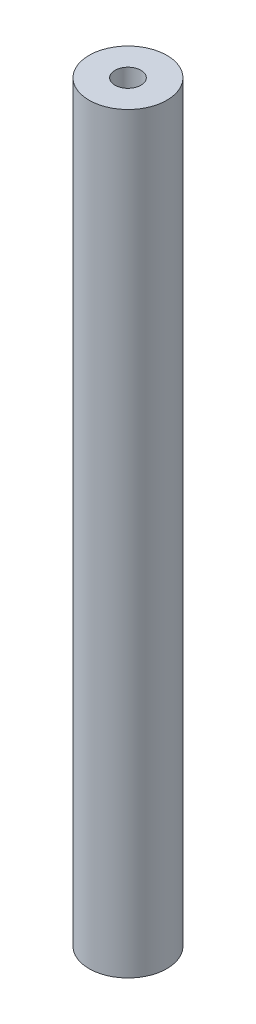
ISO-10303-21;
HEADER;
FILE_DESCRIPTION(('STEP AP214'),'2;1');
FILE_NAME('part.step','',(''),(''),'','','');
FILE_SCHEMA(('AUTOMOTIVE_DESIGN { 1 0 10303 214 1 1 1 1 }'));
ENDSEC;
DATA;
#1=APPLICATION_CONTEXT('core data for automotive mechanical design processes');
#2=APPLICATION_PROTOCOL_DEFINITION('international standard','automotive_design',2000,#1);
#3=PRODUCT_CONTEXT('',#1,'mechanical');
#4=PRODUCT('Part','Part','',(#3));
#5=PRODUCT_RELATED_PRODUCT_CATEGORY('part','',(#4));
#6=PRODUCT_DEFINITION_FORMATION('','',#4);
#7=PRODUCT_DEFINITION_CONTEXT('part definition',#1,'design');
#8=PRODUCT_DEFINITION('design','',#6,#7);
#9=PRODUCT_DEFINITION_SHAPE('','',#8);
#10=(LENGTH_UNIT() NAMED_UNIT(*) SI_UNIT(.MILLI.,.METRE.));
#11=(NAMED_UNIT(*) PLANE_ANGLE_UNIT() SI_UNIT($,.RADIAN.));
#12=(NAMED_UNIT(*) SI_UNIT($,.STERADIAN.) SOLID_ANGLE_UNIT());
#13=UNCERTAINTY_MEASURE_WITH_UNIT(LENGTH_MEASURE(1.E-05),#10,'distance_accuracy_value','');
#14=(GEOMETRIC_REPRESENTATION_CONTEXT(3) GLOBAL_UNCERTAINTY_ASSIGNED_CONTEXT((#13)) GLOBAL_UNIT_ASSIGNED_CONTEXT((#10,
#11,#12)) REPRESENTATION_CONTEXT('',''));
#15=CARTESIAN_POINT('',(0.,0.,0.));
#16=DIRECTION('',(0.,0.,1.));
#17=DIRECTION('',(1.,0.,0.));
#18=AXIS2_PLACEMENT_3D('',#15,#16,#17);
#19=CARTESIAN_POINT('',(0.,29.,0.));
#20=DIRECTION('',(0.,1.,0.));
#21=DIRECTION('',(0.,0.,1.));
#22=AXIS2_PLACEMENT_3D('',#19,#20,#21);
#23=PLANE('',#22);
#24=CARTESIAN_POINT('',(0.,29.,0.));
#25=DIRECTION('',(0.,1.,0.));
#26=DIRECTION('',(0.,0.,1.));
#27=AXIS2_PLACEMENT_3D('',#24,#25,#26);
#28=CIRCLE('',#27,1.5);
#29=CARTESIAN_POINT('',(0.,29.,1.5));
#30=VERTEX_POINT('',#29);
#31=EDGE_CURVE('E10',#30,#30,#28,.T.);
#32=ORIENTED_EDGE('',*,*,#31,.T.);
#33=EDGE_LOOP('',(#32));
#34=FACE_BOUND('',#33,.T.);
#35=CARTESIAN_POINT('',(0.,29.,0.));
#36=DIRECTION('',(0.,1.,0.));
#37=DIRECTION('',(0.,0.,1.));
#38=AXIS2_PLACEMENT_3D('',#35,#36,#37);
#39=CIRCLE('',#38,0.5);
#40=CARTESIAN_POINT('',(0.,29.,0.5));
#41=VERTEX_POINT('',#40);
#42=EDGE_CURVE('E58',#41,#41,#39,.T.);
#43=ORIENTED_EDGE('',*,*,#42,.F.);
#44=EDGE_LOOP('',(#43));
#45=FACE_BOUND('',#44,.T.);
#46=ADVANCED_FACE('F45',(#34,#45),#23,.T.);
#47=CARTESIAN_POINT('',(0.,0.,0.));
#48=DIRECTION('',(0.,1.,0.));
#49=DIRECTION('',(0.,0.,1.));
#50=AXIS2_PLACEMENT_3D('',#47,#48,#49);
#51=PLANE('',#50);
#52=CARTESIAN_POINT('',(0.,0.,0.));
#53=DIRECTION('',(0.,1.,0.));
#54=DIRECTION('',(0.,0.,1.));
#55=AXIS2_PLACEMENT_3D('',#52,#53,#54);
#56=CIRCLE('',#55,1.5);
#57=CARTESIAN_POINT('',(0.,0.,1.5));
#58=VERTEX_POINT('',#57);
#59=EDGE_CURVE('E49',#58,#58,#56,.T.);
#60=ORIENTED_EDGE('',*,*,#59,.F.);
#61=EDGE_LOOP('',(#60));
#62=FACE_BOUND('',#61,.T.);
#63=CARTESIAN_POINT('',(0.,0.,0.));
#64=DIRECTION('',(0.,1.,0.));
#65=DIRECTION('',(0.,0.,1.));
#66=AXIS2_PLACEMENT_3D('',#63,#64,#65);
#67=CIRCLE('',#66,0.5);
#68=CARTESIAN_POINT('',(0.,0.,0.5));
#69=VERTEX_POINT('',#68);
#70=EDGE_CURVE('E60',#69,#69,#67,.T.);
#71=ORIENTED_EDGE('',*,*,#70,.T.);
#72=EDGE_LOOP('',(#71));
#73=FACE_BOUND('',#72,.T.);
#74=ADVANCED_FACE('F72',(#62,#73),#51,.F.);
#75=CARTESIAN_POINT('',(0.,29.,0.));
#76=DIRECTION('',(0.,-1.,0.));
#77=DIRECTION('',(0.,0.,-1.));
#78=AXIS2_PLACEMENT_3D('',#75,#76,#77);
#79=CYLINDRICAL_SURFACE('',#78,1.5);
#80=ORIENTED_EDGE('',*,*,#31,.F.);
#81=EDGE_LOOP('',(#80));
#82=FACE_BOUND('',#81,.T.);
#83=ORIENTED_EDGE('',*,*,#59,.T.);
#84=EDGE_LOOP('',(#83));
#85=FACE_BOUND('',#84,.T.);
#86=ADVANCED_FACE('F47',(#82,#85),#79,.T.);
#87=CARTESIAN_POINT('',(0.,29.,0.));
#88=DIRECTION('',(0.,-1.,0.));
#89=DIRECTION('',(0.,0.,-1.));
#90=AXIS2_PLACEMENT_3D('',#87,#88,#89);
#91=CYLINDRICAL_SURFACE('',#90,0.5);
#92=ORIENTED_EDGE('',*,*,#42,.T.);
#93=EDGE_LOOP('',(#92));
#94=FACE_BOUND('',#93,.T.);
#95=ORIENTED_EDGE('',*,*,#70,.F.);
#96=EDGE_LOOP('',(#95));
#97=FACE_BOUND('',#96,.T.);
#98=ADVANCED_FACE('F68',(#94,#97),#91,.F.);
#99=CLOSED_SHELL('',(#46,#74,#86,#98));
#100=MANIFOLD_SOLID_BREP('B2',#99);
#101=ADVANCED_BREP_SHAPE_REPRESENTATION('',(#18,#100),#14);
#102=SHAPE_DEFINITION_REPRESENTATION(#9,#101);
ENDSEC;
END-ISO-10303-21;
